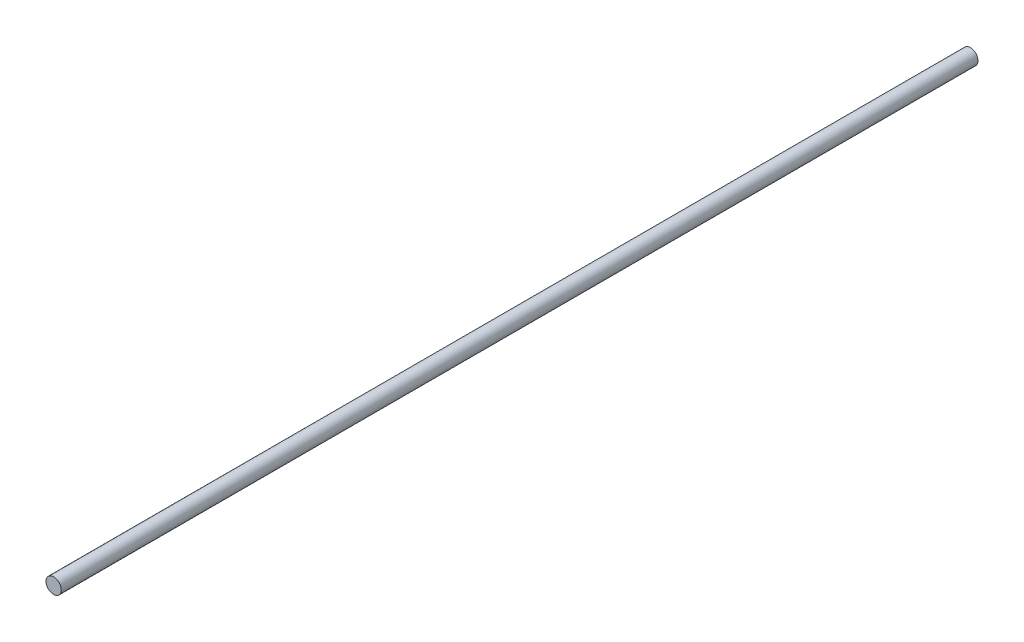
ISO-10303-21;
HEADER;
FILE_DESCRIPTION(('STEP AP214'),'2;1');
FILE_NAME('part.step','',(''),(''),'','','');
FILE_SCHEMA(('AUTOMOTIVE_DESIGN { 1 0 10303 214 1 1 1 1 }'));
ENDSEC;
DATA;
#1=APPLICATION_CONTEXT('core data for automotive mechanical design processes');
#2=APPLICATION_PROTOCOL_DEFINITION('international standard','automotive_design',2000,#1);
#3=PRODUCT_CONTEXT('',#1,'mechanical');
#4=PRODUCT('Part','Part','',(#3));
#5=PRODUCT_RELATED_PRODUCT_CATEGORY('part','',(#4));
#6=PRODUCT_DEFINITION_FORMATION('','',#4);
#7=PRODUCT_DEFINITION_CONTEXT('part definition',#1,'design');
#8=PRODUCT_DEFINITION('design','',#6,#7);
#9=PRODUCT_DEFINITION_SHAPE('','',#8);
#10=(LENGTH_UNIT() NAMED_UNIT(*) SI_UNIT(.MILLI.,.METRE.));
#11=(NAMED_UNIT(*) PLANE_ANGLE_UNIT() SI_UNIT($,.RADIAN.));
#12=(NAMED_UNIT(*) SI_UNIT($,.STERADIAN.) SOLID_ANGLE_UNIT());
#13=UNCERTAINTY_MEASURE_WITH_UNIT(LENGTH_MEASURE(1.E-05),#10,'distance_accuracy_value','');
#14=(GEOMETRIC_REPRESENTATION_CONTEXT(3) GLOBAL_UNCERTAINTY_ASSIGNED_CONTEXT((#13)) GLOBAL_UNIT_ASSIGNED_CONTEXT((#10,
#11,#12)) REPRESENTATION_CONTEXT('',''));
#15=CARTESIAN_POINT('',(0.,0.,0.));
#16=DIRECTION('',(0.,0.,1.));
#17=DIRECTION('',(1.,0.,0.));
#18=AXIS2_PLACEMENT_3D('',#15,#16,#17);
#19=CARTESIAN_POINT('',(0.,0.,381.));
#20=DIRECTION('',(0.,0.,-1.));
#21=DIRECTION('',(-1.,0.,0.));
#22=AXIS2_PLACEMENT_3D('',#19,#20,#21);
#23=CYLINDRICAL_SURFACE('',#22,6.35);
#24=CARTESIAN_POINT('',(0.,0.,381.));
#25=DIRECTION('',(0.,0.,1.));
#26=DIRECTION('',(1.,0.,0.));
#27=AXIS2_PLACEMENT_3D('',#24,#25,#26);
#28=CIRCLE('',#27,6.35);
#29=CARTESIAN_POINT('',(6.35,0.,381.));
#30=VERTEX_POINT('',#29);
#31=EDGE_CURVE('E10',#30,#30,#28,.T.);
#32=ORIENTED_EDGE('',*,*,#31,.F.);
#33=EDGE_LOOP('',(#32));
#34=FACE_BOUND('',#33,.T.);
#35=CARTESIAN_POINT('',(0.,0.,-381.));
#36=DIRECTION('',(0.,0.,1.));
#37=DIRECTION('',(1.,0.,0.));
#38=AXIS2_PLACEMENT_3D('',#35,#36,#37);
#39=CIRCLE('',#38,6.35);
#40=CARTESIAN_POINT('',(6.35,0.,-381.));
#41=VERTEX_POINT('',#40);
#42=EDGE_CURVE('E37',#41,#41,#39,.T.);
#43=ORIENTED_EDGE('',*,*,#42,.T.);
#44=EDGE_LOOP('',(#43));
#45=FACE_BOUND('',#44,.T.);
#46=ADVANCED_FACE('F34',(#34,#45),#23,.T.);
#47=CARTESIAN_POINT('',(0.,0.,381.));
#48=DIRECTION('',(0.,0.,1.));
#49=DIRECTION('',(1.,0.,0.));
#50=AXIS2_PLACEMENT_3D('',#47,#48,#49);
#51=PLANE('',#50);
#52=ORIENTED_EDGE('',*,*,#31,.T.);
#53=EDGE_LOOP('',(#52));
#54=FACE_BOUND('',#53,.T.);
#55=ADVANCED_FACE('F49',(#54),#51,.T.);
#56=CARTESIAN_POINT('',(0.,0.,-381.));
#57=DIRECTION('',(0.,0.,1.));
#58=DIRECTION('',(1.,0.,0.));
#59=AXIS2_PLACEMENT_3D('',#56,#57,#58);
#60=PLANE('',#59);
#61=ORIENTED_EDGE('',*,*,#42,.F.);
#62=EDGE_LOOP('',(#61));
#63=FACE_BOUND('',#62,.T.);
#64=ADVANCED_FACE('F47',(#63),#60,.F.);
#65=CLOSED_SHELL('',(#46,#55,#64));
#66=MANIFOLD_SOLID_BREP('B2',#65);
#67=ADVANCED_BREP_SHAPE_REPRESENTATION('',(#18,#66),#14);
#68=SHAPE_DEFINITION_REPRESENTATION(#9,#67);
ENDSEC;
END-ISO-10303-21;
